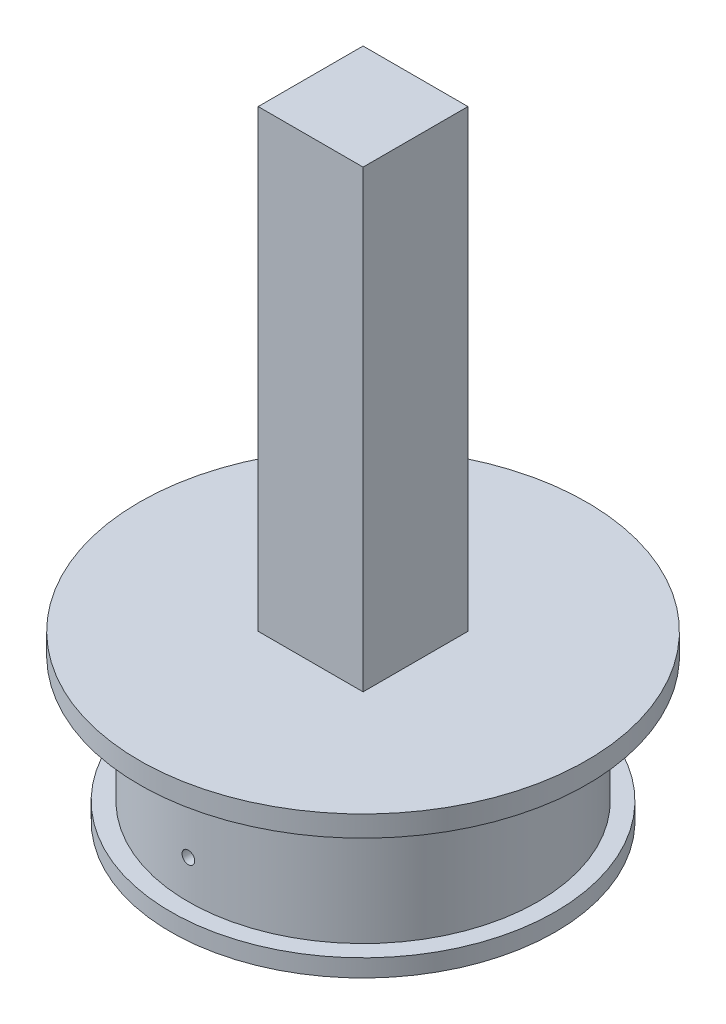
ISO-10303-21;
HEADER;
FILE_DESCRIPTION(('STEP AP214'),'2;1');
FILE_NAME('part.step','',(''),(''),'','','');
FILE_SCHEMA(('AUTOMOTIVE_DESIGN { 1 0 10303 214 1 1 1 1 }'));
ENDSEC;
DATA;
#1=APPLICATION_CONTEXT('core data for automotive mechanical design processes');
#2=APPLICATION_PROTOCOL_DEFINITION('international standard','automotive_design',2000,#1);
#3=PRODUCT_CONTEXT('',#1,'mechanical');
#4=PRODUCT('Part','Part','',(#3));
#5=PRODUCT_RELATED_PRODUCT_CATEGORY('part','',(#4));
#6=PRODUCT_DEFINITION_FORMATION('','',#4);
#7=PRODUCT_DEFINITION_CONTEXT('part definition',#1,'design');
#8=PRODUCT_DEFINITION('design','',#6,#7);
#9=PRODUCT_DEFINITION_SHAPE('','',#8);
#10=(LENGTH_UNIT() NAMED_UNIT(*) SI_UNIT(.MILLI.,.METRE.));
#11=(NAMED_UNIT(*) PLANE_ANGLE_UNIT() SI_UNIT($,.RADIAN.));
#12=(NAMED_UNIT(*) SI_UNIT($,.STERADIAN.) SOLID_ANGLE_UNIT());
#13=UNCERTAINTY_MEASURE_WITH_UNIT(LENGTH_MEASURE(1.E-05),#10,'distance_accuracy_value','');
#14=(GEOMETRIC_REPRESENTATION_CONTEXT(3) GLOBAL_UNCERTAINTY_ASSIGNED_CONTEXT((#13)) GLOBAL_UNIT_ASSIGNED_CONTEXT((#10,
#11,#12)) REPRESENTATION_CONTEXT('',''));
#15=CARTESIAN_POINT('',(0.,0.,0.));
#16=DIRECTION('',(0.,0.,1.));
#17=DIRECTION('',(1.,0.,0.));
#18=AXIS2_PLACEMENT_3D('',#15,#16,#17);
#19=CARTESIAN_POINT('',(371.877240018433,129.681947366971,37.48));
#20=DIRECTION('',(0.,1.,0.));
#21=DIRECTION('',(-1.,0.,0.));
#22=AXIS2_PLACEMENT_3D('',#19,#20,#21);
#23=CYLINDRICAL_SURFACE('',#22,25.);
#24=CARTESIAN_POINT('',(371.877240018433,129.681947366971,37.48));
#25=DIRECTION('',(0.,-1.,0.));
#26=DIRECTION('',(1.,0.,0.));
#27=AXIS2_PLACEMENT_3D('',#24,#25,#26);
#28=CIRCLE('',#27,25.);
#29=CARTESIAN_POINT('',(396.877240018433,129.681947366971,37.48));
#30=VERTEX_POINT('',#29);
#31=EDGE_CURVE('E117',#30,#30,#28,.T.);
#32=ORIENTED_EDGE('',*,*,#31,.F.);
#33=EDGE_LOOP('',(#32));
#34=FACE_BOUND('',#33,.T.);
#35=CARTESIAN_POINT('',(371.877240018433,147.681947366971,37.48));
#36=DIRECTION('',(0.,-1.,0.));
#37=DIRECTION('',(1.,0.,0.));
#38=AXIS2_PLACEMENT_3D('',#35,#36,#37);
#39=CIRCLE('',#38,25.);
#40=CARTESIAN_POINT('',(396.877240018433,147.681947366971,37.48));
#41=VERTEX_POINT('',#40);
#42=EDGE_CURVE('E39',#41,#41,#39,.T.);
#43=ORIENTED_EDGE('',*,*,#42,.T.);
#44=EDGE_LOOP('',(#43));
#45=FACE_BOUND('',#44,.T.);
#46=CARTESIAN_POINT('',(370.977240018433,135.18194736697,12.496205252204));
#47=CARTESIAN_POINT('',(370.977242254086,135.232483184961,12.4962050337831));
#48=CARTESIAN_POINT('',(370.981510756039,135.283055229283,12.4960502733588));
#49=CARTESIAN_POINT('',(370.998478748452,135.38280533165,12.4954478142544));
#50=CARTESIAN_POINT('',(371.01118827588,135.431981657415,12.4949997668449));
#51=CARTESIAN_POINT('',(371.044674957394,135.527480836153,12.4938615533524));
#52=CARTESIAN_POINT('',(371.065448123666,135.573805086501,12.4931715069645));
#53=CARTESIAN_POINT('',(371.114466587609,135.662296065318,12.4916272024234));
#54=CARTESIAN_POINT('',(371.142710076179,135.70446379699,12.4907729840416));
#55=CARTESIAN_POINT('',(371.205886708192,135.783482662128,12.4889960013106));
#56=CARTESIAN_POINT('',(371.240823252987,135.820331075597,12.4880732022558));
#57=CARTESIAN_POINT('',(371.316387976158,135.887642302645,12.4862633790766));
#58=CARTESIAN_POINT('',(371.357016382474,135.91810486037,12.4853763563867));
#59=CARTESIAN_POINT('',(371.442823372449,135.971785264207,12.4837378549938));
#60=CARTESIAN_POINT('',(371.488003104832,135.995001275247,12.4829864106442));
#61=CARTESIAN_POINT('',(371.581622115486,136.033517704658,12.4817040705542));
#62=CARTESIAN_POINT('',(371.630061377821,136.048818161724,12.4811731737357));
#63=CARTESIAN_POINT('',(371.728802008977,136.07106275288,12.4803919760831));
#64=CARTESIAN_POINT('',(371.77910255442,136.078010537457,12.4801415526728));
#65=CARTESIAN_POINT('',(371.880156584905,136.08336381547,12.4799491176025));
#66=CARTESIAN_POINT('',(371.930910067703,136.081769351194,12.4800071044157));
#67=CARTESIAN_POINT('',(372.031404545064,136.070086453239,12.480424849561));
#68=CARTESIAN_POINT('',(372.081145997847,136.060001955408,12.4807844680612));
#69=CARTESIAN_POINT('',(372.178229518345,136.03163134526,12.4817647913734));
#70=CARTESIAN_POINT('',(372.225571579594,136.013345210841,12.482385496889));
#71=CARTESIAN_POINT('',(372.316525124068,135.969085894742,12.483818288106));
#72=CARTESIAN_POINT('',(372.360135730084,135.943110911895,12.4846304186409));
#73=CARTESIAN_POINT('',(372.442378809567,135.884212563384,12.4863545512319));
#74=CARTESIAN_POINT('',(372.481011265768,135.851289173622,12.4872665536343));
#75=CARTESIAN_POINT('',(372.552224356922,135.779406315186,12.489088279615));
#76=CARTESIAN_POINT('',(372.584801545304,135.740443431916,12.4899980016064));
#77=CARTESIAN_POINT('',(372.642952815566,135.657599630956,12.4917120839836));
#78=CARTESIAN_POINT('',(372.668526896152,135.613718712358,12.4925164443498));
#79=CARTESIAN_POINT('',(372.711945639941,135.52228248604,12.4939290653747));
#80=CARTESIAN_POINT('',(372.729790186964,135.474727123103,12.4945373230858));
#81=CARTESIAN_POINT('',(372.757241082744,135.377292825898,12.4954890304407));
#82=CARTESIAN_POINT('',(372.766847463713,135.327413900716,12.4958324811198));
#83=CARTESIAN_POINT('',(372.77754509992,135.226778356385,12.4962156582545));
#84=CARTESIAN_POINT('',(372.778641132298,135.176022245671,12.4962555551045));
#85=CARTESIAN_POINT('',(372.772299412324,135.075046763925,12.4960275704167));
#86=CARTESIAN_POINT('',(372.764861674389,135.024827391987,12.495759689399));
#87=CARTESIAN_POINT('',(372.74166750204,134.926364285603,12.4949465011694));
#88=CARTESIAN_POINT('',(372.725913242462,134.878120038197,12.4944012664893));
#89=CARTESIAN_POINT('',(372.686535436693,134.784960896517,12.4930948940545));
#90=CARTESIAN_POINT('',(372.662911867286,134.740046012064,12.4923337556629));
#91=CARTESIAN_POINT('',(372.608453729008,134.654798568319,12.4906809591358));
#92=CARTESIAN_POINT('',(372.577615944706,134.614468064265,12.4897892428673));
#93=CARTESIAN_POINT('',(372.509609463738,134.539554868807,12.4879760154107));
#94=CARTESIAN_POINT('',(372.472440744911,134.504972197523,12.4870545041183));
#95=CARTESIAN_POINT('',(372.392807004096,134.442520372417,12.4852850676597));
#96=CARTESIAN_POINT('',(372.350339564518,134.414654300231,12.4844371763847));
#97=CARTESIAN_POINT('',(372.261326177171,134.366447753841,12.4829110368943));
#98=CARTESIAN_POINT('',(372.214780240722,134.346107258748,12.482232788208));
#99=CARTESIAN_POINT('',(372.118942708433,134.31353466275,12.4811225478785));
#100=CARTESIAN_POINT('',(372.0696517897,134.301300571753,12.4806904957986));
#101=CARTESIAN_POINT('',(371.96971392383,134.28528154162,12.4801211092751));
#102=CARTESIAN_POINT('',(371.919066979479,134.281496585125,12.479983774226));
#103=CARTESIAN_POINT('',(371.817885467485,134.282483488506,12.480019297931));
#104=CARTESIAN_POINT('',(371.767350852424,134.287250500744,12.4801919809529));
#105=CARTESIAN_POINT('',(371.667799750813,134.305196036715,12.4808277423161));
#106=CARTESIAN_POINT('',(371.61878326724,134.318374576939,12.4812908212267));
#107=CARTESIAN_POINT('',(371.523658331461,134.352768270218,12.4824552295996));
#108=CARTESIAN_POINT('',(371.47754992315,134.373983544544,12.4831565626571));
#109=CARTESIAN_POINT('',(371.389549928441,134.423847203863,12.4847184934282));
#110=CARTESIAN_POINT('',(371.34765819534,134.452495330135,12.4855790855979));
#111=CARTESIAN_POINT('',(371.269257503253,134.516427225964,12.487363115614));
#112=CARTESIAN_POINT('',(371.23275102836,134.551714040821,12.4882865821776));
#113=CARTESIAN_POINT('',(371.166169874743,134.627925891641,12.4900922012514));
#114=CARTESIAN_POINT('',(371.136096788302,134.668852319313,12.4909743434916));
#115=CARTESIAN_POINT('',(371.083228760155,134.755201630392,12.4925982061542));
#116=CARTESIAN_POINT('',(371.060439108388,134.800627750689,12.493339824356));
#117=CARTESIAN_POINT('',(371.022836677668,134.894629291889,12.4945972167766));
#118=CARTESIAN_POINT('',(371.008014408773,134.94320088857,12.4951132595407));
#119=CARTESIAN_POINT('',(370.990685626752,135.023722957849,12.4957236885204));
#120=CARTESIAN_POINT('',(370.985649890885,135.05515103737,12.4959034874139));
#121=CARTESIAN_POINT('',(370.978926384067,135.118363752553,12.4961443379494));
#122=CARTESIAN_POINT('',(370.977238611678,135.150148388062,12.4962053896424));
#123=CARTESIAN_POINT('',(370.977240018433,135.18194736697,12.496205252204));
#124=B_SPLINE_CURVE_WITH_KNOTS('',3,(#46,#47,#48,#49,#50,#51,#52,#53,#54,#55,#56,#57,#58,#59,
#60,#61,#62,#63,#64,#65,#66,#67,#68,#69,#70,#71,#72,#73,#74,#75,#76,#77,#78,#79,#80,#81,#82,#83,
#84,#85,#86,#87,#88,#89,#90,#91,#92,#93,#94,#95,#96,#97,#98,#99,#100,#101,#102,#103,#104,#105,
#106,#107,#108,#109,#110,#111,#112,#113,#114,#115,#116,#117,#118,#119,#120,#121,#122,#123),
.UNSPECIFIED.,.T.,.F.,(4,2,2,2,2,2,2,2,2,2,2,2,2,2,2,2,2,2,2,2,2,2,2,2,2,2,2,2,2,2,2,2,2,2,2,2,
2,2,4),(0.,0.151491381568071,0.30316322021267,0.454760146022622,0.606320392927847,
0.757957866703181,0.909601414800331,1.06128333307561,1.21296450980507,1.36457937099075,
1.51619348161551,1.66773734495923,1.81928161670552,1.97086141693729,2.1224417428974,
2.27410808374727,2.42577445262437,2.57744310107262,2.72911115649504,2.88069406946361,
3.03227672632514,3.18381976272343,3.33536324622419,3.48697440296111,3.63858609041615,
3.79026720681638,3.94194790220895,4.09359134677018,4.24523447977466,4.39679168181025,
4.54834918096387,4.69990896714727,4.85146347860208,5.00308768142131,5.15474936834887,
5.30652095773112,5.45811136928747,5.55343530997431,5.64875920971241),.UNSPECIFIED.);
#125=CARTESIAN_POINT('',(370.977240018433,135.18194736697,12.496205252204));
#126=VERTEX_POINT('',#125);
#127=EDGE_CURVE('E44',#126,#126,#124,.T.);
#128=ORIENTED_EDGE('',*,*,#127,.F.);
#129=EDGE_LOOP('',(#128));
#130=FACE_BOUND('',#129,.T.);
#131=CARTESIAN_POINT('',(370.977240018433,135.18194736697,62.463794747796));
#132=CARTESIAN_POINT('',(370.977242254086,135.13141154898,62.4637949662169));
#133=CARTESIAN_POINT('',(370.981510756039,135.080839504658,62.4639497266412));
#134=CARTESIAN_POINT('',(370.998478748452,134.98108940229,62.4645521857456));
#135=CARTESIAN_POINT('',(371.01118827588,134.931913076526,62.4650002331551));
#136=CARTESIAN_POINT('',(371.044674957394,134.836413897788,62.4661384466476));
#137=CARTESIAN_POINT('',(371.065448123666,134.79008964744,62.4668284930355));
#138=CARTESIAN_POINT('',(371.114466587609,134.701598668622,62.4683727975766));
#139=CARTESIAN_POINT('',(371.142710076179,134.659430936951,62.4692270159584));
#140=CARTESIAN_POINT('',(371.205886708192,134.580412071813,62.4710039986894));
#141=CARTESIAN_POINT('',(371.240823252987,134.543563658344,62.4719267977442));
#142=CARTESIAN_POINT('',(371.316387976158,134.476252431295,62.4737366209234));
#143=CARTESIAN_POINT('',(371.357016382474,134.445789873571,62.4746236436133));
#144=CARTESIAN_POINT('',(371.442823372449,134.392109469734,62.4762621450062));
#145=CARTESIAN_POINT('',(371.488003104832,134.368893458693,62.4770135893558));
#146=CARTESIAN_POINT('',(371.581622115486,134.330377029283,62.4782959294458));
#147=CARTESIAN_POINT('',(371.630061377821,134.315076572216,62.4788268262643));
#148=CARTESIAN_POINT('',(371.728802008977,134.292831981061,62.4796080239169));
#149=CARTESIAN_POINT('',(371.77910255442,134.285884196484,62.4798584473272));
#150=CARTESIAN_POINT('',(371.880156584905,134.280530918471,62.4800508823975));
#151=CARTESIAN_POINT('',(371.930910067703,134.282125382747,62.4799928955843));
#152=CARTESIAN_POINT('',(372.031404545064,134.293808280702,62.479575150439));
#153=CARTESIAN_POINT('',(372.081145997847,134.303892778533,62.4792155319388));
#154=CARTESIAN_POINT('',(372.178229518345,134.332263388681,62.4782352086266));
#155=CARTESIAN_POINT('',(372.225571579594,134.3505495231,62.477614503111));
#156=CARTESIAN_POINT('',(372.316525124068,134.394808839198,62.476181711894));
#157=CARTESIAN_POINT('',(372.360135730084,134.420783822046,62.4753695813591));
#158=CARTESIAN_POINT('',(372.442378809567,134.479682170557,62.4736454487681));
#159=CARTESIAN_POINT('',(372.481011265768,134.512605560319,62.4727334463657));
#160=CARTESIAN_POINT('',(372.552224356922,134.584488418755,62.470911720385));
#161=CARTESIAN_POINT('',(372.584801545304,134.623451302025,62.4700019983936));
#162=CARTESIAN_POINT('',(372.642952815566,134.706295102985,62.4682879160164));
#163=CARTESIAN_POINT('',(372.668526896152,134.750176021583,62.4674835556502));
#164=CARTESIAN_POINT('',(372.711945639941,134.841612247901,62.4660709346253));
#165=CARTESIAN_POINT('',(372.729790186964,134.889167610838,62.4654626769142));
#166=CARTESIAN_POINT('',(372.757241082744,134.986601908043,62.4645109695593));
#167=CARTESIAN_POINT('',(372.766847463713,135.036480833225,62.4641675188802));
#168=CARTESIAN_POINT('',(372.77754509992,135.137116377555,62.4637843417455));
#169=CARTESIAN_POINT('',(372.778641132298,135.18787248827,62.4637444448955));
#170=CARTESIAN_POINT('',(372.772299412324,135.288847970016,62.4639724295833));
#171=CARTESIAN_POINT('',(372.764861674389,135.339067341954,62.464240310601));
#172=CARTESIAN_POINT('',(372.74166750204,135.437530448338,62.4650534988306));
#173=CARTESIAN_POINT('',(372.725913242462,135.485774695743,62.4655987335107));
#174=CARTESIAN_POINT('',(372.686535436693,135.578933837424,62.4669051059455));
#175=CARTESIAN_POINT('',(372.662911867286,135.623848721876,62.4676662443371));
#176=CARTESIAN_POINT('',(372.608453729008,135.709096165622,62.4693190408642));
#177=CARTESIAN_POINT('',(372.577615944706,135.749426669675,62.4702107571327));
#178=CARTESIAN_POINT('',(372.509609463738,135.824339865134,62.4720239845893));
#179=CARTESIAN_POINT('',(372.472440744911,135.858922536418,62.4729454958817));
#180=CARTESIAN_POINT('',(372.392807004096,135.921374361524,62.4747149323403));
#181=CARTESIAN_POINT('',(372.350339564518,135.94924043371,62.4755628236153));
#182=CARTESIAN_POINT('',(372.261326177171,135.9974469801,62.4770889631057));
#183=CARTESIAN_POINT('',(372.214780240722,136.017787475193,62.477767211792));
#184=CARTESIAN_POINT('',(372.118942708433,136.050360071191,62.4788774521215));
#185=CARTESIAN_POINT('',(372.0696517897,136.062594162188,62.4793095042014));
#186=CARTESIAN_POINT('',(371.96971392383,136.078613192321,62.4798788907249));
#187=CARTESIAN_POINT('',(371.919066979479,136.082398148816,62.480016225774));
#188=CARTESIAN_POINT('',(371.817885467485,136.081411245435,62.479980702069));
#189=CARTESIAN_POINT('',(371.767350852424,136.076644233197,62.4798080190471));
#190=CARTESIAN_POINT('',(371.667799750813,136.058698697226,62.4791722576839));
#191=CARTESIAN_POINT('',(371.61878326724,136.045520157002,62.4787091787733));
#192=CARTESIAN_POINT('',(371.523658331461,136.011126463723,62.4775447704004));
#193=CARTESIAN_POINT('',(371.47754992315,135.989911189397,62.4768434373429));
#194=CARTESIAN_POINT('',(371.389549928441,135.940047530078,62.4752815065718));
#195=CARTESIAN_POINT('',(371.34765819534,135.911399403806,62.4744209144021));
#196=CARTESIAN_POINT('',(371.269257503253,135.847467507976,62.472636884386));
#197=CARTESIAN_POINT('',(371.23275102836,135.81218069312,62.4717134178224));
#198=CARTESIAN_POINT('',(371.166169874743,135.735968842299,62.4699077987486));
#199=CARTESIAN_POINT('',(371.136096788302,135.695042414627,62.4690256565084));
#200=CARTESIAN_POINT('',(371.083228760155,135.608693103548,62.4674017938458));
#201=CARTESIAN_POINT('',(371.060439108388,135.563266983252,62.466660175644));
#202=CARTESIAN_POINT('',(371.022836677668,135.469265442052,62.4654027832234));
#203=CARTESIAN_POINT('',(371.008014408773,135.420693845371,62.4648867404593));
#204=CARTESIAN_POINT('',(370.990685626752,135.340171776092,62.4642763114796));
#205=CARTESIAN_POINT('',(370.985649890885,135.308743696571,62.4640965125861));
#206=CARTESIAN_POINT('',(370.978926384067,135.245530981388,62.4638556620506));
#207=CARTESIAN_POINT('',(370.977238611678,135.213746345879,62.4637946103577));
#208=CARTESIAN_POINT('',(370.977240018433,135.18194736697,62.463794747796));
#209=B_SPLINE_CURVE_WITH_KNOTS('',3,(#131,#132,#133,#134,#135,#136,#137,#138,#139,#140,#141,
#142,#143,#144,#145,#146,#147,#148,#149,#150,#151,#152,#153,#154,#155,#156,#157,#158,#159,#160,
#161,#162,#163,#164,#165,#166,#167,#168,#169,#170,#171,#172,#173,#174,#175,#176,#177,#178,#179,
#180,#181,#182,#183,#184,#185,#186,#187,#188,#189,#190,#191,#192,#193,#194,#195,#196,#197,#198,
#199,#200,#201,#202,#203,#204,#205,#206,#207,#208),.UNSPECIFIED.,.T.,.F.,(4,2,2,2,2,2,2,2,2,2,2,
2,2,2,2,2,2,2,2,2,2,2,2,2,2,2,2,2,2,2,2,2,2,2,2,2,2,2,4),(0.,0.151491381568071,0.30316322021267,
0.454760146022622,0.606320392927847,0.757957866703239,0.909601414800328,1.06128333307561,
1.21296450980507,1.36457937099074,1.51619348161551,1.66773734495922,1.81928161670552,
1.97086141693729,2.1224417428974,2.27410808374726,2.42577445262436,2.57744310107259,
2.72911115649504,2.88069406946364,3.03227672632514,3.18381976272343,3.33536324622419,
3.48697440296111,3.63858609041615,3.79026720681638,3.94194790220895,4.09359134677018,
4.24523447977466,4.39679168181025,4.54834918096387,4.69990896714727,4.85146347860208,
5.00308768142131,5.15474936834887,5.30652095773112,5.45811136928747,5.55343530997431,
5.64875920971241),.UNSPECIFIED.);
#210=CARTESIAN_POINT('',(370.977240018433,135.18194736697,62.463794747796));
#211=VERTEX_POINT('',#210);
#212=EDGE_CURVE('E11',#211,#211,#209,.T.);
#213=ORIENTED_EDGE('',*,*,#212,.F.);
#214=EDGE_LOOP('',(#213));
#215=FACE_BOUND('',#214,.T.);
#216=ADVANCED_FACE('F34',(#34,#45,#130,#215),#23,.T.);
#217=CARTESIAN_POINT('',(371.877240018433,129.681947366971,37.48));
#218=DIRECTION('',(0.,1.,0.));
#219=DIRECTION('',(-1.,0.,0.));
#220=AXIS2_PLACEMENT_3D('',#217,#218,#219);
#221=CYLINDRICAL_SURFACE('',#220,23.);
#222=CARTESIAN_POINT('',(370.977240018433,135.18194736697,14.4976154413864));
#223=CARTESIAN_POINT('',(370.977242252935,135.232479994503,14.4976152041113));
#224=CARTESIAN_POINT('',(370.981510218102,135.28304877038,14.4974469873962));
#225=CARTESIAN_POINT('',(370.998475953961,135.382792206955,14.4967921514857));
#226=CARTESIAN_POINT('',(371.011183740065,135.431965138845,14.4963051540078));
#227=CARTESIAN_POINT('',(371.044665524251,135.527457512416,14.4950680065915));
#228=CARTESIAN_POINT('',(371.065435510835,135.573778359944,14.4943179875423));
#229=CARTESIAN_POINT('',(371.114446195987,135.662263207371,14.4926394755452));
#230=CARTESIAN_POINT('',(371.142685094661,135.70442820541,14.4917110256112));
#231=CARTESIAN_POINT('',(371.205853713538,135.783445737519,14.4897795459787));
#232=CARTESIAN_POINT('',(371.240787325189,135.820295159852,14.4887764731126));
#233=CARTESIAN_POINT('',(371.316346356449,135.887609137162,14.4868091921602));
#234=CARTESIAN_POINT('',(371.356972004835,135.918073435381,14.4858449856381));
#235=CARTESIAN_POINT('',(371.442776232516,135.971759433351,14.4840638295266));
#236=CARTESIAN_POINT('',(371.487956184936,135.994978940099,14.483246924557));
#237=CARTESIAN_POINT('',(371.581576811792,136.033502094461,14.4818528412569));
#238=CARTESIAN_POINT('',(371.63001746858,136.048805784913,14.4812756616291));
#239=CARTESIAN_POINT('',(371.728757933405,136.071055304805,14.4804263498154));
#240=CARTESIAN_POINT('',(371.779056767693,136.078005449514,14.4801540601347));
#241=CARTESIAN_POINT('',(371.880107895011,136.083363896055,14.4799446901945));
#242=CARTESIAN_POINT('',(371.930860185536,136.081772245047,14.4800076080844));
#243=CARTESIAN_POINT('',(372.031348332428,136.070095888832,14.4804614282409));
#244=CARTESIAN_POINT('',(372.081084730044,136.060015833735,14.4808521509294));
#245=CARTESIAN_POINT('',(372.178158886887,136.03165600627,14.4819173484355));
#246=CARTESIAN_POINT('',(372.225496638944,136.013376209389,14.4825918241014));
#247=CARTESIAN_POINT('',(372.316444740431,135.96913047133,14.4841488367785));
#248=CARTESIAN_POINT('',(372.360054054411,135.94316240387,14.4850314313336));
#249=CARTESIAN_POINT('',(372.442296036471,135.884278827417,14.4869052440252));
#250=CARTESIAN_POINT('',(372.480928683793,135.851363289449,14.4878964626146));
#251=CARTESIAN_POINT('',(372.552147803519,135.779492816451,14.4898766326168));
#252=CARTESIAN_POINT('',(372.58473020517,135.740533847371,14.4908655820642));
#253=CARTESIAN_POINT('',(372.642892592588,135.657696618347,14.4927290516112));
#254=CARTESIAN_POINT('',(372.668472576966,135.613818357428,14.4936035716882));
#255=CARTESIAN_POINT('',(372.7119036013,135.522385729932,14.4951395199188));
#256=CARTESIAN_POINT('',(372.729754500919,135.474831296624,14.4958009442031));
#257=CARTESIAN_POINT('',(372.757217975333,135.377397285693,14.4968359603227));
#258=CARTESIAN_POINT('',(372.76683058814,135.327517718799,14.497209553486));
#259=CARTESIAN_POINT('',(372.777539611642,135.22688477302,14.497626537268));
#260=CARTESIAN_POINT('',(372.778641666216,135.176131995604,14.4976701467189));
#261=CARTESIAN_POINT('',(372.772313005878,135.075162183356,14.4974228166189));
#262=CARTESIAN_POINT('',(372.764882308073,135.024945147451,14.4971318777387));
#263=CARTESIAN_POINT('',(372.741703750151,134.926488085073,14.4962484456873));
#264=CARTESIAN_POINT('',(372.725958462191,134.878247452161,14.4956560457764));
#265=CARTESIAN_POINT('',(372.686600280127,134.785093924408,14.4942365472378));
#266=CARTESIAN_POINT('',(372.662987358438,134.740181041235,14.4934094477871));
#267=CARTESIAN_POINT('',(372.608549669865,134.654931939448,14.4916132484451));
#268=CARTESIAN_POINT('',(372.577721105593,134.614598147336,14.4906440738845));
#269=CARTESIAN_POINT('',(372.509732806007,134.539676543254,14.4886732359756));
#270=CARTESIAN_POINT('',(372.472573044962,134.505088754638,14.4876715724954));
#271=CARTESIAN_POINT('',(372.392952980304,134.442622088564,14.4857480283398));
#272=CARTESIAN_POINT('',(372.350489818487,134.414746852655,14.4848261911431));
#273=CARTESIAN_POINT('',(372.261482843544,134.366521457335,14.4831668250486));
#274=CARTESIAN_POINT('',(372.214939043008,134.346171274706,14.4824292955822));
#275=CARTESIAN_POINT('',(372.119105655635,134.313580037148,14.4812218840591));
#276=CARTESIAN_POINT('',(372.069816868071,134.301336634964,14.4807519245351));
#277=CARTESIAN_POINT('',(371.969881374407,134.285298811426,14.4801323168409));
#278=CARTESIAN_POINT('',(371.919234672047,134.281504366797,14.4799826677882));
#279=CARTESIAN_POINT('',(371.818057283738,134.282472432628,14.4800205433979));
#280=CARTESIAN_POINT('',(371.767526542834,134.287229218743,14.4802078425013));
#281=CARTESIAN_POINT('',(371.667981536136,134.30515291573,14.4808980741603));
#282=CARTESIAN_POINT('',(371.618967273296,134.318319842982,14.4814010073308));
#283=CARTESIAN_POINT('',(371.52384495443,134.352689043873,14.4826658844985));
#284=CARTESIAN_POINT('',(371.477736938852,134.373891429317,14.4834278320996));
#285=CARTESIAN_POINT('',(371.389735349118,134.423728343641,14.485124949373));
#286=CARTESIAN_POINT('',(371.347841631735,134.452362619819,14.4860601131553));
#287=CARTESIAN_POINT('',(371.269430066021,134.516269703529,14.4879990223009));
#288=CARTESIAN_POINT('',(371.232915252432,134.551546233201,14.4890028059152));
#289=CARTESIAN_POINT('',(371.166315580249,134.627739031544,14.4909656630337));
#290=CARTESIAN_POINT('',(371.136232311969,134.66865669098,14.4919247254342));
#291=CARTESIAN_POINT('',(371.083341050268,134.754992594452,14.4936904336108));
#292=CARTESIAN_POINT('',(371.060538677906,134.800414280443,14.4944969614311));
#293=CARTESIAN_POINT('',(371.022910392659,134.894409814566,14.495864628825));
#294=CARTESIAN_POINT('',(371.00807500356,134.942979840507,14.4964260597761));
#295=CARTESIAN_POINT('',(370.990717515809,135.023536821888,14.4970907069593));
#296=CARTESIAN_POINT('',(370.98566985031,135.055001315448,14.4972866223895));
#297=CARTESIAN_POINT('',(370.978930398585,135.118288212333,14.4975490643144));
#298=CARTESIAN_POINT('',(370.977238610644,135.150110615473,14.4976155908754));
#299=CARTESIAN_POINT('',(370.977240018433,135.18194736697,14.4976154413864));
#300=B_SPLINE_CURVE_WITH_KNOTS('',3,(#222,#223,#224,#225,#226,#227,#228,#229,#230,#231,#232,
#233,#234,#235,#236,#237,#238,#239,#240,#241,#242,#243,#244,#245,#246,#247,#248,#249,#250,#251,
#252,#253,#254,#255,#256,#257,#258,#259,#260,#261,#262,#263,#264,#265,#266,#267,#268,#269,#270,
#271,#272,#273,#274,#275,#276,#277,#278,#279,#280,#281,#282,#283,#284,#285,#286,#287,#288,#289,
#290,#291,#292,#293,#294,#295,#296,#297,#298,#299),.UNSPECIFIED.,.T.,.F.,(4,2,2,2,2,2,2,2,2,2,2,
2,2,2,2,2,2,2,2,2,2,2,2,2,2,2,2,2,2,2,2,2,2,2,2,2,2,2,4),(0.,0.151481671142711,
0.303143425334183,0.454729813933945,0.606279705742597,0.757917957868973,0.909562306454549,
1.06125251345103,1.21294189953645,1.36455289228092,1.5161630479666,1.66769020272286,
1.81921781045556,1.9707873641315,2.12235754995543,2.27402934927046,2.42570117865786,
2.57737576186147,2.72904964526033,2.88062293567248,3.03219592217268,3.18372204631007,
3.33524870175714,3.4868552814143,3.6384624772552,3.79015173543837,3.94184052562579,
4.09348537627429,4.24512980914487,4.39667276634643,4.54821601870573,4.69976137969786,
4.85130158846936,5.00292697043571,5.1545898012201,5.30636943852031,5.45796814161629,
5.55340522889675,5.64884226742103),.UNSPECIFIED.);
#301=CARTESIAN_POINT('',(370.977240018433,135.18194736697,14.4976154413864));
#302=VERTEX_POINT('',#301);
#303=EDGE_CURVE('E119',#302,#302,#300,.T.);
#304=ORIENTED_EDGE('',*,*,#303,.T.);
#305=EDGE_LOOP('',(#304));
#306=FACE_BOUND('',#305,.T.);
#307=CARTESIAN_POINT('',(371.877240018433,129.681947366971,37.48));
#308=DIRECTION('',(0.,-1.,0.));
#309=DIRECTION('',(1.,0.,0.));
#310=AXIS2_PLACEMENT_3D('',#307,#308,#309);
#311=CIRCLE('',#310,23.);
#312=CARTESIAN_POINT('',(394.877240018433,129.681947366971,37.48));
#313=VERTEX_POINT('',#312);
#314=EDGE_CURVE('E118',#313,#313,#311,.T.);
#315=ORIENTED_EDGE('',*,*,#314,.T.);
#316=EDGE_LOOP('',(#315));
#317=FACE_BOUND('',#316,.T.);
#318=CARTESIAN_POINT('',(371.877240018433,147.681947366971,37.48));
#319=DIRECTION('',(0.,-1.,0.));
#320=DIRECTION('',(1.,0.,0.));
#321=AXIS2_PLACEMENT_3D('',#318,#319,#320);
#322=CIRCLE('',#321,23.);
#323=CARTESIAN_POINT('',(394.877240018433,147.681947366971,37.48));
#324=VERTEX_POINT('',#323);
#325=EDGE_CURVE('E108',#324,#324,#322,.F.);
#326=ORIENTED_EDGE('',*,*,#325,.T.);
#327=EDGE_LOOP('',(#326));
#328=FACE_BOUND('',#327,.T.);
#329=CARTESIAN_POINT('',(370.977240018433,135.18194736697,60.4623845586136));
#330=CARTESIAN_POINT('',(370.977242252935,135.131414739438,60.4623847958887));
#331=CARTESIAN_POINT('',(370.981510218102,135.080845963561,60.4625530126038));
#332=CARTESIAN_POINT('',(370.998475953961,134.981102526986,60.4632078485143));
#333=CARTESIAN_POINT('',(371.011183740065,134.931929595096,60.4636948459922));
#334=CARTESIAN_POINT('',(371.044665524251,134.836437221525,60.4649319934085));
#335=CARTESIAN_POINT('',(371.065435510835,134.790116373997,60.4656820124577));
#336=CARTESIAN_POINT('',(371.114446195987,134.70163152657,60.4673605244548));
#337=CARTESIAN_POINT('',(371.142685094661,134.659466528531,60.4682889743888));
#338=CARTESIAN_POINT('',(371.205853713538,134.580448996422,60.4702204540213));
#339=CARTESIAN_POINT('',(371.240787325189,134.543599574089,60.4712235268874));
#340=CARTESIAN_POINT('',(371.316346356449,134.476285596779,60.4731908078398));
#341=CARTESIAN_POINT('',(371.356972004835,134.44582129856,60.4741550143619));
#342=CARTESIAN_POINT('',(371.442776232516,134.39213530059,60.4759361704734));
#343=CARTESIAN_POINT('',(371.487956184936,134.368915793842,60.476753075443));
#344=CARTESIAN_POINT('',(371.581576811792,134.33039263948,60.4781471587431));
#345=CARTESIAN_POINT('',(371.63001746858,134.315088949028,60.4787243383709));
#346=CARTESIAN_POINT('',(371.728757933405,134.292839429136,60.4795736501846));
#347=CARTESIAN_POINT('',(371.779056767693,134.285889284427,60.4798459398653));
#348=CARTESIAN_POINT('',(371.880107895011,134.280530837886,60.4800553098055));
#349=CARTESIAN_POINT('',(371.930860185536,134.282122488894,60.4799923919156));
#350=CARTESIAN_POINT('',(372.031348332428,134.293798845108,60.4795385717591));
#351=CARTESIAN_POINT('',(372.081084730044,134.303878900205,60.4791478490706));
#352=CARTESIAN_POINT('',(372.178158886887,134.332238727671,60.4780826515645));
#353=CARTESIAN_POINT('',(372.225496638944,134.350518524552,60.4774081758986));
#354=CARTESIAN_POINT('',(372.316444740431,134.394764262611,60.4758511632215));
#355=CARTESIAN_POINT('',(372.360054054411,134.42073233007,60.4749685686664));
#356=CARTESIAN_POINT('',(372.442296036471,134.479615906523,60.4730947559748));
#357=CARTESIAN_POINT('',(372.480928683793,134.512531444492,60.4721035373854));
#358=CARTESIAN_POINT('',(372.552147803519,134.58440191749,60.4701233673832));
#359=CARTESIAN_POINT('',(372.58473020517,134.62336088657,60.4691344179358));
#360=CARTESIAN_POINT('',(372.642892592588,134.706198115594,60.4672709483888));
#361=CARTESIAN_POINT('',(372.668472576966,134.750076376512,60.4663964283118));
#362=CARTESIAN_POINT('',(372.7119036013,134.841509004009,60.4648604800812));
#363=CARTESIAN_POINT('',(372.729754500919,134.889063437316,60.4641990557969));
#364=CARTESIAN_POINT('',(372.757217975333,134.986497448248,60.4631640396773));
#365=CARTESIAN_POINT('',(372.76683058814,135.036377015142,60.462790446514));
#366=CARTESIAN_POINT('',(372.777539611642,135.137009960921,60.462373462732));
#367=CARTESIAN_POINT('',(372.778641666216,135.187762738337,60.4623298532811));
#368=CARTESIAN_POINT('',(372.772313005878,135.288732550584,60.4625771833811));
#369=CARTESIAN_POINT('',(372.764882308073,135.338949586489,60.4628681222613));
#370=CARTESIAN_POINT('',(372.741703750151,135.437406648867,60.4637515543127));
#371=CARTESIAN_POINT('',(372.725958462191,135.485647281779,60.4643439542236));
#372=CARTESIAN_POINT('',(372.686600280127,135.578800809533,60.4657634527622));
#373=CARTESIAN_POINT('',(372.662987358438,135.623713692706,60.4665905522129));
#374=CARTESIAN_POINT('',(372.608549669865,135.708962794493,60.4683867515549));
#375=CARTESIAN_POINT('',(372.577721105593,135.749296586605,60.4693559261155));
#376=CARTESIAN_POINT('',(372.509732806007,135.824218190687,60.4713267640244));
#377=CARTESIAN_POINT('',(372.472573044962,135.858805979302,60.4723284275046));
#378=CARTESIAN_POINT('',(372.392952980304,135.921272645377,60.4742519716602));
#379=CARTESIAN_POINT('',(372.350489818487,135.949147881286,60.4751738088569));
#380=CARTESIAN_POINT('',(372.261482843544,135.997373276606,60.4768331749514));
#381=CARTESIAN_POINT('',(372.214939043008,136.017723459234,60.4775707044178));
#382=CARTESIAN_POINT('',(372.119105655635,136.050314696792,60.4787781159409));
#383=CARTESIAN_POINT('',(372.069816868071,136.062558098977,60.4792480754649));
#384=CARTESIAN_POINT('',(371.969881374407,136.078595922515,60.4798676831591));
#385=CARTESIAN_POINT('',(371.919234672047,136.082390367144,60.4800173322118));
#386=CARTESIAN_POINT('',(371.818057283738,136.081422301313,60.4799794566021));
#387=CARTESIAN_POINT('',(371.767526542834,136.076665515198,60.4797921574987));
#388=CARTESIAN_POINT('',(371.667981536136,136.058741818211,60.4791019258397));
#389=CARTESIAN_POINT('',(371.618967273296,136.045574890959,60.4785989926692));
#390=CARTESIAN_POINT('',(371.52384495443,136.011205690068,60.4773341155015));
#391=CARTESIAN_POINT('',(371.477736938852,135.990003304624,60.4765721679004));
#392=CARTESIAN_POINT('',(371.389735349118,135.9401663903,60.474875050627));
#393=CARTESIAN_POINT('',(371.347841631735,135.911532114121,60.4739398868447));
#394=CARTESIAN_POINT('',(371.269430066021,135.847625030412,60.4720009776991));
#395=CARTESIAN_POINT('',(371.232915252432,135.81234850074,60.4709971940848));
#396=CARTESIAN_POINT('',(371.166315580249,135.736155702397,60.4690343369663));
#397=CARTESIAN_POINT('',(371.136232311969,135.695238042961,60.4680752745658));
#398=CARTESIAN_POINT('',(371.083341050268,135.608902139489,60.4663095663891));
#399=CARTESIAN_POINT('',(371.060538677906,135.563480453498,60.4655030385689));
#400=CARTESIAN_POINT('',(371.022910392659,135.469484919375,60.464135371175));
#401=CARTESIAN_POINT('',(371.00807500356,135.420914893434,60.4635739402239));
#402=CARTESIAN_POINT('',(370.990717515809,135.340357912053,60.4629092930407));
#403=CARTESIAN_POINT('',(370.98566985031,135.308893418492,60.4627133776105));
#404=CARTESIAN_POINT('',(370.978930398585,135.245606521608,60.4624509356856));
#405=CARTESIAN_POINT('',(370.977238610644,135.213784118467,60.4623844091246));
#406=CARTESIAN_POINT('',(370.977240018433,135.18194736697,60.4623845586136));
#407=B_SPLINE_CURVE_WITH_KNOTS('',3,(#329,#330,#331,#332,#333,#334,#335,#336,#337,#338,#339,
#340,#341,#342,#343,#344,#345,#346,#347,#348,#349,#350,#351,#352,#353,#354,#355,#356,#357,#358,
#359,#360,#361,#362,#363,#364,#365,#366,#367,#368,#369,#370,#371,#372,#373,#374,#375,#376,#377,
#378,#379,#380,#381,#382,#383,#384,#385,#386,#387,#388,#389,#390,#391,#392,#393,#394,#395,#396,
#397,#398,#399,#400,#401,#402,#403,#404,#405,#406),.UNSPECIFIED.,.T.,.F.,(4,2,2,2,2,2,2,2,2,2,2,
2,2,2,2,2,2,2,2,2,2,2,2,2,2,2,2,2,2,2,2,2,2,2,2,2,2,2,4),(0.,0.151481671142711,
0.303143425334183,0.454729813933945,0.606279705742597,0.757917957868894,0.909562306454548,
1.06125251345103,1.21294189953645,1.36455289228092,1.5161630479666,1.66769020272286,
1.81921781045556,1.9707873641315,2.12235754995542,2.27402934927046,2.42570117865786,
2.57737576186145,2.72904964526033,2.88062293567248,3.03219592217268,3.18372204631007,
3.33524870175714,3.4868552814143,3.6384624772552,3.79015173543838,3.94184052562579,
4.09348537627429,4.24512980914487,4.39667276634643,4.54821601870573,4.69976137969786,
4.85130158846936,5.00292697043571,5.1545898012201,5.30636943852031,5.45796814161629,
5.55340522889675,5.64884226742103),.UNSPECIFIED.);
#408=CARTESIAN_POINT('',(370.977240018433,135.18194736697,60.4623845586136));
#409=VERTEX_POINT('',#408);
#410=EDGE_CURVE('E110',#409,#409,#407,.T.);
#411=ORIENTED_EDGE('',*,*,#410,.T.);
#412=EDGE_LOOP('',(#411));
#413=FACE_BOUND('',#412,.T.);
#414=ADVANCED_FACE('F124',(#306,#317,#328,#413),#221,.F.);
#415=CARTESIAN_POINT('',(371.877240018433,129.681947366971,37.48));
#416=DIRECTION('',(0.,-1.,0.));
#417=DIRECTION('',(1.,0.,0.));
#418=AXIS2_PLACEMENT_3D('',#415,#416,#417);
#419=PLANE('',#418);
#420=CARTESIAN_POINT('',(371.877240018433,129.681947366971,37.48));
#421=DIRECTION('',(0.,-1.,0.));
#422=DIRECTION('',(1.,0.,0.));
#423=AXIS2_PLACEMENT_3D('',#420,#421,#422);
#424=CIRCLE('',#423,27.5);
#425=CARTESIAN_POINT('',(399.377240018433,129.681947366971,37.48));
#426=VERTEX_POINT('',#425);
#427=EDGE_CURVE('E175',#426,#426,#424,.T.);
#428=ORIENTED_EDGE('',*,*,#427,.F.);
#429=EDGE_LOOP('',(#428));
#430=FACE_BOUND('',#429,.T.);
#431=ORIENTED_EDGE('',*,*,#31,.T.);
#432=EDGE_LOOP('',(#431));
#433=FACE_BOUND('',#432,.T.);
#434=ADVANCED_FACE('F129',(#430,#433),#419,.F.);
#435=CARTESIAN_POINT('',(371.877240018433,127.181947366971,37.48));
#436=DIRECTION('',(0.,-1.,0.));
#437=DIRECTION('',(1.,0.,0.));
#438=AXIS2_PLACEMENT_3D('',#435,#436,#437);
#439=PLANE('',#438);
#440=CARTESIAN_POINT('',(371.877240018433,127.181947366971,37.48));
#441=DIRECTION('',(0.,-1.,0.));
#442=DIRECTION('',(1.,0.,0.));
#443=AXIS2_PLACEMENT_3D('',#440,#441,#442);
#444=CIRCLE('',#443,27.5);
#445=CARTESIAN_POINT('',(399.377240018433,127.181947366971,37.48));
#446=VERTEX_POINT('',#445);
#447=EDGE_CURVE('E178',#446,#446,#444,.T.);
#448=ORIENTED_EDGE('',*,*,#447,.T.);
#449=EDGE_LOOP('',(#448));
#450=FACE_BOUND('',#449,.T.);
#451=CARTESIAN_POINT('',(371.877240018433,127.181947366971,37.48));
#452=DIRECTION('',(0.,-1.,0.));
#453=DIRECTION('',(1.,0.,0.));
#454=AXIS2_PLACEMENT_3D('',#451,#452,#453);
#455=CIRCLE('',#454,23.5);
#456=CARTESIAN_POINT('',(395.377240018433,127.181947366971,37.48));
#457=VERTEX_POINT('',#456);
#458=EDGE_CURVE('E172',#457,#457,#455,.T.);
#459=ORIENTED_EDGE('',*,*,#458,.F.);
#460=EDGE_LOOP('',(#459));
#461=FACE_BOUND('',#460,.T.);
#462=ADVANCED_FACE('F138',(#450,#461),#439,.T.);
#463=CARTESIAN_POINT('',(371.877240018433,127.181947366971,37.48));
#464=DIRECTION('',(0.,1.,0.));
#465=DIRECTION('',(-1.,0.,0.));
#466=AXIS2_PLACEMENT_3D('',#463,#464,#465);
#467=CYLINDRICAL_SURFACE('',#466,27.5);
#468=ORIENTED_EDGE('',*,*,#447,.F.);
#469=EDGE_LOOP('',(#468));
#470=FACE_BOUND('',#469,.T.);
#471=ORIENTED_EDGE('',*,*,#427,.T.);
#472=EDGE_LOOP('',(#471));
#473=FACE_BOUND('',#472,.T.);
#474=ADVANCED_FACE('F133',(#470,#473),#467,.T.);
#475=CARTESIAN_POINT('',(371.877240018433,127.181947366971,37.48));
#476=DIRECTION('',(0.,1.,0.));
#477=DIRECTION('',(-1.,0.,0.));
#478=AXIS2_PLACEMENT_3D('',#475,#476,#477);
#479=CYLINDRICAL_SURFACE('',#478,23.5);
#480=ORIENTED_EDGE('',*,*,#458,.T.);
#481=EDGE_LOOP('',(#480));
#482=FACE_BOUND('',#481,.T.);
#483=CARTESIAN_POINT('',(371.877240018433,129.681947366971,37.48));
#484=DIRECTION('',(0.,-1.,0.));
#485=DIRECTION('',(1.,0.,0.));
#486=AXIS2_PLACEMENT_3D('',#483,#484,#485);
#487=CIRCLE('',#486,23.5);
#488=CARTESIAN_POINT('',(395.377240018433,129.681947366971,37.48));
#489=VERTEX_POINT('',#488);
#490=EDGE_CURVE('E174',#489,#489,#487,.T.);
#491=ORIENTED_EDGE('',*,*,#490,.F.);
#492=EDGE_LOOP('',(#491));
#493=FACE_BOUND('',#492,.T.);
#494=ADVANCED_FACE('F137',(#482,#493),#479,.F.);
#495=CARTESIAN_POINT('',(371.877240018433,129.681947366971,37.48));
#496=DIRECTION('',(0.,-1.,0.));
#497=DIRECTION('',(1.,0.,0.));
#498=AXIS2_PLACEMENT_3D('',#495,#496,#497);
#499=PLANE('',#498);
#500=ORIENTED_EDGE('',*,*,#314,.F.);
#501=EDGE_LOOP('',(#500));
#502=FACE_BOUND('',#501,.T.);
#503=ORIENTED_EDGE('',*,*,#490,.T.);
#504=EDGE_LOOP('',(#503));
#505=FACE_BOUND('',#504,.T.);
#506=ADVANCED_FACE('F131',(#502,#505),#499,.T.);
#507=CARTESIAN_POINT('',(371.877240018433,135.18194736697,83.48));
#508=DIRECTION('',(0.,0.,-1.));
#509=DIRECTION('',(-1.,0.,0.));
#510=AXIS2_PLACEMENT_3D('',#507,#508,#509);
#511=CYLINDRICAL_SURFACE('',#510,0.900000000000007);
#512=ORIENTED_EDGE('',*,*,#303,.F.);
#513=EDGE_LOOP('',(#512));
#514=FACE_BOUND('',#513,.T.);
#515=ORIENTED_EDGE('',*,*,#127,.T.);
#516=EDGE_LOOP('',(#515));
#517=FACE_BOUND('',#516,.T.);
#518=ADVANCED_FACE('F150',(#514,#517),#511,.F.);
#519=ORIENTED_EDGE('',*,*,#410,.F.);
#520=EDGE_LOOP('',(#519));
#521=FACE_BOUND('',#520,.T.);
#522=ORIENTED_EDGE('',*,*,#212,.T.);
#523=EDGE_LOOP('',(#522));
#524=FACE_BOUND('',#523,.T.);
#525=ADVANCED_FACE('F36',(#521,#524),#511,.F.);
#526=CARTESIAN_POINT('',(371.877240018433,147.681947366971,37.48));
#527=DIRECTION('',(0.,1.,0.));
#528=DIRECTION('',(-1.,0.,0.));
#529=AXIS2_PLACEMENT_3D('',#526,#527,#528);
#530=PLANE('',#529);
#531=ORIENTED_EDGE('',*,*,#325,.F.);
#532=EDGE_LOOP('',(#531));
#533=FACE_BOUND('',#532,.T.);
#534=ADVANCED_FACE('F204',(#533),#530,.F.);
#535=CARTESIAN_POINT('',(371.877240018433,147.681947366971,37.48));
#536=DIRECTION('',(0.,1.,0.));
#537=DIRECTION('',(-1.,0.,0.));
#538=AXIS2_PLACEMENT_3D('',#535,#536,#537);
#539=CIRCLE('',#538,32.);
#540=CARTESIAN_POINT('',(339.877240018433,147.68194736697,37.48));
#541=VERTEX_POINT('',#540);
#542=EDGE_CURVE('E98',#541,#541,#539,.T.);
#543=ORIENTED_EDGE('',*,*,#542,.F.);
#544=EDGE_LOOP('',(#543));
#545=FACE_BOUND('',#544,.T.);
#546=ORIENTED_EDGE('',*,*,#42,.F.);
#547=EDGE_LOOP('',(#546));
#548=FACE_BOUND('',#547,.T.);
#549=ADVANCED_FACE('F209',(#545,#548),#530,.F.);
#550=CARTESIAN_POINT('',(371.877240018433,150.681947366971,37.48));
#551=DIRECTION('',(0.,-1.,0.));
#552=DIRECTION('',(1.,0.,0.));
#553=AXIS2_PLACEMENT_3D('',#550,#551,#552);
#554=CYLINDRICAL_SURFACE('',#553,32.);
#555=CARTESIAN_POINT('',(371.877240018433,150.681947366971,37.48));
#556=DIRECTION('',(0.,1.,0.));
#557=DIRECTION('',(-1.,0.,0.));
#558=AXIS2_PLACEMENT_3D('',#555,#556,#557);
#559=CIRCLE('',#558,32.);
#560=CARTESIAN_POINT('',(339.877240018433,150.68194736697,37.48));
#561=VERTEX_POINT('',#560);
#562=EDGE_CURVE('E101',#561,#561,#559,.T.);
#563=ORIENTED_EDGE('',*,*,#562,.F.);
#564=EDGE_LOOP('',(#563));
#565=FACE_BOUND('',#564,.T.);
#566=ORIENTED_EDGE('',*,*,#542,.T.);
#567=EDGE_LOOP('',(#566));
#568=FACE_BOUND('',#567,.T.);
#569=ADVANCED_FACE('F162',(#565,#568),#554,.T.);
#570=CARTESIAN_POINT('',(371.877240018433,150.681947366971,37.48));
#571=DIRECTION('',(0.,1.,0.));
#572=DIRECTION('',(-1.,0.,0.));
#573=AXIS2_PLACEMENT_3D('',#570,#571,#572);
#574=PLANE('',#573);
#575=DIRECTION('',(0.,0.,-1.));
#576=VECTOR('',#575,1.);
#577=CARTESIAN_POINT('',(379.377240018433,150.681947366971,29.98));
#578=LINE('',#577,#576);
#579=CARTESIAN_POINT('',(379.377240018433,150.681947366971,44.98));
#580=VERTEX_POINT('',#579);
#581=CARTESIAN_POINT('',(379.377240018433,150.681947366971,29.98));
#582=VERTEX_POINT('',#581);
#583=EDGE_CURVE('E52',#580,#582,#578,.T.);
#584=ORIENTED_EDGE('',*,*,#583,.F.);
#585=DIRECTION('',(1.,0.,0.));
#586=VECTOR('',#585,1.);
#587=CARTESIAN_POINT('',(364.377240018433,150.681947366971,44.98));
#588=LINE('',#587,#586);
#589=CARTESIAN_POINT('',(364.377240018433,150.681947366971,44.98));
#590=VERTEX_POINT('',#589);
#591=EDGE_CURVE('E56',#590,#580,#588,.T.);
#592=ORIENTED_EDGE('',*,*,#591,.F.);
#593=DIRECTION('',(0.,0.,1.));
#594=VECTOR('',#593,1.);
#595=CARTESIAN_POINT('',(364.377240018433,150.681947366971,29.98));
#596=LINE('',#595,#594);
#597=CARTESIAN_POINT('',(364.377240018433,150.681947366971,29.98));
#598=VERTEX_POINT('',#597);
#599=EDGE_CURVE('E344',#598,#590,#596,.T.);
#600=ORIENTED_EDGE('',*,*,#599,.F.);
#601=DIRECTION('',(-1.,0.,0.));
#602=VECTOR('',#601,1.);
#603=CARTESIAN_POINT('',(364.377240018433,150.681947366971,29.98));
#604=LINE('',#603,#602);
#605=EDGE_CURVE('E350',#582,#598,#604,.T.);
#606=ORIENTED_EDGE('',*,*,#605,.F.);
#607=EDGE_LOOP('',(#584,#592,#600,#606));
#608=FACE_BOUND('',#607,.T.);
#609=ORIENTED_EDGE('',*,*,#562,.T.);
#610=EDGE_LOOP('',(#609));
#611=FACE_BOUND('',#610,.T.);
#612=ADVANCED_FACE('F218',(#608,#611),#574,.T.);
#613=CARTESIAN_POINT('',(379.377240018433,215.681947366971,29.98));
#614=DIRECTION('',(-1.,0.,0.));
#615=DIRECTION('',(0.,-1.,0.));
#616=AXIS2_PLACEMENT_3D('',#613,#614,#615);
#617=PLANE('',#616);
#618=ORIENTED_EDGE('',*,*,#583,.T.);
#619=DIRECTION('',(0.,-1.,0.));
#620=VECTOR('',#619,1.);
#621=CARTESIAN_POINT('',(379.377240018433,215.681947366971,29.98));
#622=LINE('',#621,#620);
#623=CARTESIAN_POINT('',(379.377240018433,215.681947366971,29.98));
#624=VERTEX_POINT('',#623);
#625=EDGE_CURVE('E81',#624,#582,#622,.T.);
#626=ORIENTED_EDGE('',*,*,#625,.F.);
#627=DIRECTION('',(0.,0.,-1.));
#628=VECTOR('',#627,1.);
#629=CARTESIAN_POINT('',(379.377240018433,215.681947366971,29.98));
#630=LINE('',#629,#628);
#631=CARTESIAN_POINT('',(379.377240018433,215.681947366971,44.98));
#632=VERTEX_POINT('',#631);
#633=EDGE_CURVE('E87',#632,#624,#630,.T.);
#634=ORIENTED_EDGE('',*,*,#633,.F.);
#635=DIRECTION('',(0.,-1.,0.));
#636=VECTOR('',#635,1.);
#637=CARTESIAN_POINT('',(379.377240018433,215.681947366971,44.98));
#638=LINE('',#637,#636);
#639=EDGE_CURVE('E342',#632,#580,#638,.T.);
#640=ORIENTED_EDGE('',*,*,#639,.T.);
#641=EDGE_LOOP('',(#618,#626,#634,#640));
#642=FACE_BOUND('',#641,.T.);
#643=ADVANCED_FACE('F97',(#642),#617,.F.);
#644=CARTESIAN_POINT('',(364.377240018433,215.681947366971,29.98));
#645=DIRECTION('',(0.,0.,1.));
#646=DIRECTION('',(1.,0.,0.));
#647=AXIS2_PLACEMENT_3D('',#644,#645,#646);
#648=PLANE('',#647);
#649=ORIENTED_EDGE('',*,*,#605,.T.);
#650=DIRECTION('',(0.,-1.,0.));
#651=VECTOR('',#650,1.);
#652=CARTESIAN_POINT('',(364.377240018433,215.681947366971,29.98));
#653=LINE('',#652,#651);
#654=CARTESIAN_POINT('',(364.377240018433,215.681947366971,29.98));
#655=VERTEX_POINT('',#654);
#656=EDGE_CURVE('E83',#655,#598,#653,.T.);
#657=ORIENTED_EDGE('',*,*,#656,.F.);
#658=DIRECTION('',(-1.,0.,0.));
#659=VECTOR('',#658,1.);
#660=CARTESIAN_POINT('',(364.377240018433,215.681947366971,29.98));
#661=LINE('',#660,#659);
#662=EDGE_CURVE('E76',#624,#655,#661,.T.);
#663=ORIENTED_EDGE('',*,*,#662,.F.);
#664=ORIENTED_EDGE('',*,*,#625,.T.);
#665=EDGE_LOOP('',(#649,#657,#663,#664));
#666=FACE_BOUND('',#665,.T.);
#667=ADVANCED_FACE('F79',(#666),#648,.F.);
#668=CARTESIAN_POINT('',(364.377240018433,215.681947366971,29.98));
#669=DIRECTION('',(1.,0.,0.));
#670=DIRECTION('',(0.,1.,0.));
#671=AXIS2_PLACEMENT_3D('',#668,#669,#670);
#672=PLANE('',#671);
#673=ORIENTED_EDGE('',*,*,#599,.T.);
#674=DIRECTION('',(0.,-1.,0.));
#675=VECTOR('',#674,1.);
#676=CARTESIAN_POINT('',(364.377240018433,215.681947366971,44.98));
#677=LINE('',#676,#675);
#678=CARTESIAN_POINT('',(364.377240018433,215.681947366971,44.98));
#679=VERTEX_POINT('',#678);
#680=EDGE_CURVE('E103',#679,#590,#677,.T.);
#681=ORIENTED_EDGE('',*,*,#680,.F.);
#682=DIRECTION('',(0.,0.,1.));
#683=VECTOR('',#682,1.);
#684=CARTESIAN_POINT('',(364.377240018433,215.681947366971,29.98));
#685=LINE('',#684,#683);
#686=EDGE_CURVE('E86',#655,#679,#685,.T.);
#687=ORIENTED_EDGE('',*,*,#686,.F.);
#688=ORIENTED_EDGE('',*,*,#656,.T.);
#689=EDGE_LOOP('',(#673,#681,#687,#688));
#690=FACE_BOUND('',#689,.T.);
#691=ADVANCED_FACE('F225',(#690),#672,.F.);
#692=CARTESIAN_POINT('',(364.377240018433,215.681947366971,44.98));
#693=DIRECTION('',(0.,0.,-1.));
#694=DIRECTION('',(-1.,0.,0.));
#695=AXIS2_PLACEMENT_3D('',#692,#693,#694);
#696=PLANE('',#695);
#697=ORIENTED_EDGE('',*,*,#591,.T.);
#698=ORIENTED_EDGE('',*,*,#639,.F.);
#699=DIRECTION('',(1.,0.,0.));
#700=VECTOR('',#699,1.);
#701=CARTESIAN_POINT('',(364.377240018433,215.681947366971,44.98));
#702=LINE('',#701,#700);
#703=EDGE_CURVE('E92',#679,#632,#702,.T.);
#704=ORIENTED_EDGE('',*,*,#703,.F.);
#705=ORIENTED_EDGE('',*,*,#680,.T.);
#706=EDGE_LOOP('',(#697,#698,#704,#705));
#707=FACE_BOUND('',#706,.T.);
#708=ADVANCED_FACE('F228',(#707),#696,.F.);
#709=CARTESIAN_POINT('',(-8.32907573574823E-13,215.681947366969,0.));
#710=DIRECTION('',(0.,1.,0.));
#711=DIRECTION('',(-1.,0.,0.));
#712=AXIS2_PLACEMENT_3D('',#709,#710,#711);
#713=PLANE('',#712);
#714=ORIENTED_EDGE('',*,*,#633,.T.);
#715=ORIENTED_EDGE('',*,*,#662,.T.);
#716=ORIENTED_EDGE('',*,*,#686,.T.);
#717=ORIENTED_EDGE('',*,*,#703,.T.);
#718=EDGE_LOOP('',(#714,#715,#716,#717));
#719=FACE_BOUND('',#718,.T.);
#720=ADVANCED_FACE('F90',(#719),#713,.T.);
#721=CLOSED_SHELL('',(#216,#414,#434,#462,#474,#494,#506,#518,#525,#534,#549,#569,#612,#643,
#667,#691,#708,#720));
#722=MANIFOLD_SOLID_BREP('B2',#721);
#723=ADVANCED_BREP_SHAPE_REPRESENTATION('',(#18,#722),#14);
#724=SHAPE_DEFINITION_REPRESENTATION(#9,#723);
ENDSEC;
END-ISO-10303-21;
